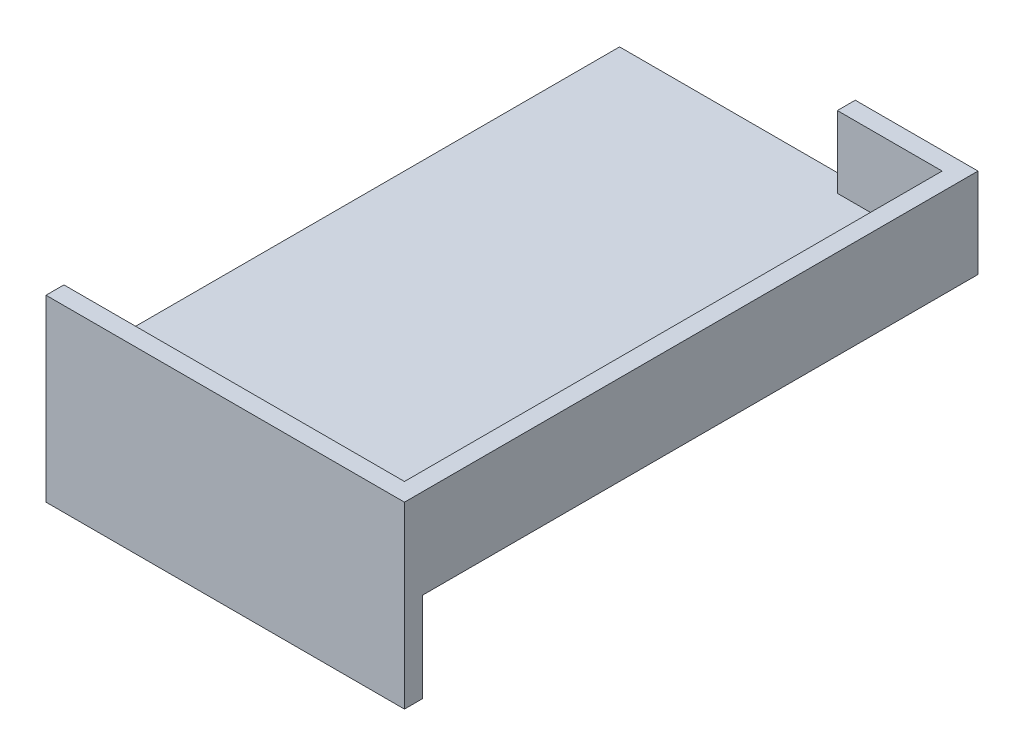
ISO-10303-21;
HEADER;
FILE_DESCRIPTION(('STEP AP214'),'2;1');
FILE_NAME('part.step','',(''),(''),'','','');
FILE_SCHEMA(('AUTOMOTIVE_DESIGN { 1 0 10303 214 1 1 1 1 }'));
ENDSEC;
DATA;
#1=APPLICATION_CONTEXT('core data for automotive mechanical design processes');
#2=APPLICATION_PROTOCOL_DEFINITION('international standard','automotive_design',2000,#1);
#3=PRODUCT_CONTEXT('',#1,'mechanical');
#4=PRODUCT('Part','Part','',(#3));
#5=PRODUCT_RELATED_PRODUCT_CATEGORY('part','',(#4));
#6=PRODUCT_DEFINITION_FORMATION('','',#4);
#7=PRODUCT_DEFINITION_CONTEXT('part definition',#1,'design');
#8=PRODUCT_DEFINITION('design','',#6,#7);
#9=PRODUCT_DEFINITION_SHAPE('','',#8);
#10=(LENGTH_UNIT() NAMED_UNIT(*) SI_UNIT(.MILLI.,.METRE.));
#11=(NAMED_UNIT(*) PLANE_ANGLE_UNIT() SI_UNIT($,.RADIAN.));
#12=(NAMED_UNIT(*) SI_UNIT($,.STERADIAN.) SOLID_ANGLE_UNIT());
#13=UNCERTAINTY_MEASURE_WITH_UNIT(LENGTH_MEASURE(1.E-05),#10,'distance_accuracy_value','');
#14=(GEOMETRIC_REPRESENTATION_CONTEXT(3) GLOBAL_UNCERTAINTY_ASSIGNED_CONTEXT((#13)) GLOBAL_UNIT_ASSIGNED_CONTEXT((#10,
#11,#12)) REPRESENTATION_CONTEXT('',''));
#15=CARTESIAN_POINT('',(0.,0.,0.));
#16=DIRECTION('',(0.,0.,1.));
#17=DIRECTION('',(1.,0.,0.));
#18=AXIS2_PLACEMENT_3D('',#15,#16,#17);
#19=CARTESIAN_POINT('',(0.,5.,0.));
#20=DIRECTION('',(0.,-1.,0.));
#21=DIRECTION('',(0.,0.,-1.));
#22=AXIS2_PLACEMENT_3D('',#19,#20,#21);
#23=PLANE('',#22);
#24=DIRECTION('',(-1.,0.,0.));
#25=VECTOR('',#24,1.);
#26=CARTESIAN_POINT('',(0.,5.,-155.));
#27=LINE('',#26,#25);
#28=CARTESIAN_POINT('',(45.,5.,-155.));
#29=VERTEX_POINT('',#28);
#30=CARTESIAN_POINT('',(15.7633115521065,5.,-155.));
#31=VERTEX_POINT('',#30);
#32=EDGE_CURVE('E148',#29,#31,#27,.T.);
#33=ORIENTED_EDGE('',*,*,#32,.T.);
#34=DIRECTION('',(0.,0.,-1.));
#35=VECTOR('',#34,1.);
#36=CARTESIAN_POINT('',(15.7633115521065,5.,0.));
#37=LINE('',#36,#35);
#38=CARTESIAN_POINT('',(15.7633115521065,5.,-160.));
#39=VERTEX_POINT('',#38);
#40=EDGE_CURVE('E132',#31,#39,#37,.T.);
#41=ORIENTED_EDGE('',*,*,#40,.T.);
#42=DIRECTION('',(-1.,0.,0.));
#43=VECTOR('',#42,1.);
#44=CARTESIAN_POINT('',(-50.,5.,-160.));
#45=LINE('',#44,#43);
#46=CARTESIAN_POINT('',(-50.,5.,-160.));
#47=VERTEX_POINT('',#46);
#48=EDGE_CURVE('E56',#39,#47,#45,.T.);
#49=ORIENTED_EDGE('',*,*,#48,.T.);
#50=DIRECTION('',(0.,0.,1.));
#51=VECTOR('',#50,1.);
#52=CARTESIAN_POINT('',(-50.,5.,0.));
#53=LINE('',#52,#51);
#54=CARTESIAN_POINT('',(-50.,5.,-5.));
#55=VERTEX_POINT('',#54);
#56=EDGE_CURVE('E194',#47,#55,#53,.T.);
#57=ORIENTED_EDGE('',*,*,#56,.T.);
#58=DIRECTION('',(-1.,0.,0.));
#59=VECTOR('',#58,1.);
#60=CARTESIAN_POINT('',(0.,5.,-5.));
#61=LINE('',#60,#59);
#62=CARTESIAN_POINT('',(45.,5.,-5.));
#63=VERTEX_POINT('',#62);
#64=EDGE_CURVE('E48',#63,#55,#61,.T.);
#65=ORIENTED_EDGE('',*,*,#64,.F.);
#66=DIRECTION('',(0.,0.,-1.));
#67=VECTOR('',#66,1.);
#68=CARTESIAN_POINT('',(45.,5.,0.));
#69=LINE('',#68,#67);
#70=EDGE_CURVE('E162',#63,#29,#69,.T.);
#71=ORIENTED_EDGE('',*,*,#70,.T.);
#72=EDGE_LOOP('',(#33,#41,#49,#57,#65,#71));
#73=FACE_BOUND('',#72,.T.);
#74=ADVANCED_FACE('F33',(#73),#23,.F.);
#75=CARTESIAN_POINT('',(0.,0.,0.));
#76=DIRECTION('',(0.,-1.,0.));
#77=DIRECTION('',(0.,0.,-1.));
#78=AXIS2_PLACEMENT_3D('',#75,#76,#77);
#79=PLANE('',#78);
#80=DIRECTION('',(0.,0.,1.));
#81=VECTOR('',#80,1.);
#82=CARTESIAN_POINT('',(-50.,0.,0.));
#83=LINE('',#82,#81);
#84=CARTESIAN_POINT('',(-50.,0.,-160.));
#85=VERTEX_POINT('',#84);
#86=CARTESIAN_POINT('',(-50.,0.,-5.));
#87=VERTEX_POINT('',#86);
#88=EDGE_CURVE('E193',#85,#87,#83,.T.);
#89=ORIENTED_EDGE('',*,*,#88,.F.);
#90=DIRECTION('',(-1.,0.,0.));
#91=VECTOR('',#90,1.);
#92=CARTESIAN_POINT('',(-50.,0.,-160.));
#93=LINE('',#92,#91);
#94=CARTESIAN_POINT('',(50.,0.,-160.));
#95=VERTEX_POINT('',#94);
#96=EDGE_CURVE('E196',#95,#85,#93,.T.);
#97=ORIENTED_EDGE('',*,*,#96,.F.);
#98=DIRECTION('',(0.,0.,-1.));
#99=VECTOR('',#98,1.);
#100=CARTESIAN_POINT('',(50.,0.,0.));
#101=LINE('',#100,#99);
#102=CARTESIAN_POINT('',(50.,0.,-5.));
#103=VERTEX_POINT('',#102);
#104=EDGE_CURVE('E69',#103,#95,#101,.T.);
#105=ORIENTED_EDGE('',*,*,#104,.F.);
#106=DIRECTION('',(-1.,0.,0.));
#107=VECTOR('',#106,1.);
#108=CARTESIAN_POINT('',(0.,0.,-5.));
#109=LINE('',#108,#107);
#110=EDGE_CURVE('E41',#103,#87,#109,.T.);
#111=ORIENTED_EDGE('',*,*,#110,.T.);
#112=EDGE_LOOP('',(#89,#97,#105,#111));
#113=FACE_BOUND('',#112,.T.);
#114=ADVANCED_FACE('F225',(#113),#79,.T.);
#115=CARTESIAN_POINT('',(-50.,5.,0.));
#116=DIRECTION('',(1.,0.,0.));
#117=DIRECTION('',(0.,0.,-1.));
#118=AXIS2_PLACEMENT_3D('',#115,#116,#117);
#119=PLANE('',#118);
#120=DIRECTION('',(0.,-1.,0.));
#121=VECTOR('',#120,1.);
#122=CARTESIAN_POINT('',(-50.,5.,0.));
#123=LINE('',#122,#121);
#124=CARTESIAN_POINT('',(-50.,25.,0.));
#125=VERTEX_POINT('',#124);
#126=CARTESIAN_POINT('',(-50.,-25.,0.));
#127=VERTEX_POINT('',#126);
#128=EDGE_CURVE('E209',#125,#127,#123,.T.);
#129=ORIENTED_EDGE('',*,*,#128,.F.);
#130=DIRECTION('',(0.,0.,1.));
#131=VECTOR('',#130,1.);
#132=CARTESIAN_POINT('',(-50.,25.,-5.));
#133=LINE('',#132,#131);
#134=CARTESIAN_POINT('',(-50.,25.,-5.));
#135=VERTEX_POINT('',#134);
#136=EDGE_CURVE('E188',#135,#125,#133,.T.);
#137=ORIENTED_EDGE('',*,*,#136,.F.);
#138=DIRECTION('',(0.,-1.,0.));
#139=VECTOR('',#138,1.);
#140=CARTESIAN_POINT('',(-50.,-25.,-5.));
#141=LINE('',#140,#139);
#142=EDGE_CURVE('E172',#135,#55,#141,.T.);
#143=ORIENTED_EDGE('',*,*,#142,.T.);
#144=ORIENTED_EDGE('',*,*,#56,.F.);
#145=DIRECTION('',(0.,-1.,0.));
#146=VECTOR('',#145,1.);
#147=CARTESIAN_POINT('',(-50.,5.,-160.));
#148=LINE('',#147,#146);
#149=EDGE_CURVE('E198',#47,#85,#148,.T.);
#150=ORIENTED_EDGE('',*,*,#149,.T.);
#151=ORIENTED_EDGE('',*,*,#88,.T.);
#152=CARTESIAN_POINT('',(-50.,-25.,-5.));
#153=VERTEX_POINT('',#152);
#154=EDGE_CURVE('E171',#87,#153,#141,.T.);
#155=ORIENTED_EDGE('',*,*,#154,.T.);
#156=DIRECTION('',(0.,0.,1.));
#157=VECTOR('',#156,1.);
#158=CARTESIAN_POINT('',(-50.,-25.,-5.));
#159=LINE('',#158,#157);
#160=EDGE_CURVE('E185',#153,#127,#159,.T.);
#161=ORIENTED_EDGE('',*,*,#160,.T.);
#162=EDGE_LOOP('',(#129,#137,#143,#144,#150,#151,#155,#161));
#163=FACE_BOUND('',#162,.T.);
#164=ADVANCED_FACE('F35',(#163),#119,.F.);
#165=CARTESIAN_POINT('',(-50.,5.,0.));
#166=DIRECTION('',(0.,0.,-1.));
#167=DIRECTION('',(-1.,0.,0.));
#168=AXIS2_PLACEMENT_3D('',#165,#166,#167);
#169=PLANE('',#168);
#170=DIRECTION('',(1.,0.,0.));
#171=VECTOR('',#170,1.);
#172=CARTESIAN_POINT('',(50.,-25.,0.));
#173=LINE('',#172,#171);
#174=CARTESIAN_POINT('',(50.,-25.,0.));
#175=VERTEX_POINT('',#174);
#176=EDGE_CURVE('E169',#127,#175,#173,.T.);
#177=ORIENTED_EDGE('',*,*,#176,.T.);
#178=DIRECTION('',(0.,-1.,0.));
#179=VECTOR('',#178,1.);
#180=CARTESIAN_POINT('',(50.,5.,0.));
#181=LINE('',#180,#179);
#182=CARTESIAN_POINT('',(50.,25.,0.));
#183=VERTEX_POINT('',#182);
#184=EDGE_CURVE('E207',#183,#175,#181,.T.);
#185=ORIENTED_EDGE('',*,*,#184,.F.);
#186=DIRECTION('',(-1.,0.,0.));
#187=VECTOR('',#186,1.);
#188=CARTESIAN_POINT('',(50.,25.,0.));
#189=LINE('',#188,#187);
#190=EDGE_CURVE('E165',#183,#125,#189,.T.);
#191=ORIENTED_EDGE('',*,*,#190,.T.);
#192=ORIENTED_EDGE('',*,*,#128,.T.);
#193=EDGE_LOOP('',(#177,#185,#191,#192));
#194=FACE_BOUND('',#193,.T.);
#195=ADVANCED_FACE('F212',(#194),#169,.F.);
#196=CARTESIAN_POINT('',(50.,5.,0.));
#197=DIRECTION('',(-1.,0.,0.));
#198=DIRECTION('',(0.,0.,1.));
#199=AXIS2_PLACEMENT_3D('',#196,#197,#198);
#200=PLANE('',#199);
#201=ORIENTED_EDGE('',*,*,#104,.T.);
#202=DIRECTION('',(0.,-1.,0.));
#203=VECTOR('',#202,1.);
#204=CARTESIAN_POINT('',(50.,5.,-160.));
#205=LINE('',#204,#203);
#206=CARTESIAN_POINT('',(50.,25.,-160.));
#207=VERTEX_POINT('',#206);
#208=EDGE_CURVE('E205',#207,#95,#205,.T.);
#209=ORIENTED_EDGE('',*,*,#208,.F.);
#210=DIRECTION('',(0.,0.,1.));
#211=VECTOR('',#210,1.);
#212=CARTESIAN_POINT('',(50.,25.,-5.));
#213=LINE('',#212,#211);
#214=EDGE_CURVE('E178',#207,#183,#213,.T.);
#215=ORIENTED_EDGE('',*,*,#214,.T.);
#216=ORIENTED_EDGE('',*,*,#184,.T.);
#217=DIRECTION('',(0.,0.,1.));
#218=VECTOR('',#217,1.);
#219=CARTESIAN_POINT('',(50.,-25.,-5.));
#220=LINE('',#219,#218);
#221=CARTESIAN_POINT('',(50.,-25.,-5.));
#222=VERTEX_POINT('',#221);
#223=EDGE_CURVE('E182',#222,#175,#220,.T.);
#224=ORIENTED_EDGE('',*,*,#223,.F.);
#225=DIRECTION('',(0.,1.,0.));
#226=VECTOR('',#225,1.);
#227=CARTESIAN_POINT('',(50.,-25.,-5.));
#228=LINE('',#227,#226);
#229=EDGE_CURVE('E166',#222,#103,#228,.T.);
#230=ORIENTED_EDGE('',*,*,#229,.T.);
#231=EDGE_LOOP('',(#201,#209,#215,#216,#224,#230));
#232=FACE_BOUND('',#231,.T.);
#233=ADVANCED_FACE('F221',(#232),#200,.F.);
#234=CARTESIAN_POINT('',(-50.,5.,-160.));
#235=DIRECTION('',(0.,0.,1.));
#236=DIRECTION('',(1.,0.,0.));
#237=AXIS2_PLACEMENT_3D('',#234,#235,#236);
#238=PLANE('',#237);
#239=ORIENTED_EDGE('',*,*,#48,.F.);
#240=DIRECTION('',(0.,1.,0.));
#241=VECTOR('',#240,1.);
#242=CARTESIAN_POINT('',(15.7633115521065,0.,-160.));
#243=LINE('',#242,#241);
#244=CARTESIAN_POINT('',(15.7633115521065,25.,-160.));
#245=VERTEX_POINT('',#244);
#246=EDGE_CURVE('E137',#39,#245,#243,.T.);
#247=ORIENTED_EDGE('',*,*,#246,.T.);
#248=DIRECTION('',(1.,0.,0.));
#249=VECTOR('',#248,1.);
#250=CARTESIAN_POINT('',(45.,25.,-160.));
#251=LINE('',#250,#249);
#252=EDGE_CURVE('E146',#245,#207,#251,.T.);
#253=ORIENTED_EDGE('',*,*,#252,.T.);
#254=ORIENTED_EDGE('',*,*,#208,.T.);
#255=ORIENTED_EDGE('',*,*,#96,.T.);
#256=ORIENTED_EDGE('',*,*,#149,.F.);
#257=EDGE_LOOP('',(#239,#247,#253,#254,#255,#256));
#258=FACE_BOUND('',#257,.T.);
#259=ADVANCED_FACE('F227',(#258),#238,.F.);
#260=CARTESIAN_POINT('',(50.,-25.,-5.));
#261=DIRECTION('',(0.,-1.,0.));
#262=DIRECTION('',(1.,0.,0.));
#263=AXIS2_PLACEMENT_3D('',#260,#261,#262);
#264=PLANE('',#263);
#265=ORIENTED_EDGE('',*,*,#176,.F.);
#266=ORIENTED_EDGE('',*,*,#160,.F.);
#267=DIRECTION('',(1.,0.,0.));
#268=VECTOR('',#267,1.);
#269=CARTESIAN_POINT('',(50.,-25.,-5.));
#270=LINE('',#269,#268);
#271=EDGE_CURVE('E175',#153,#222,#270,.T.);
#272=ORIENTED_EDGE('',*,*,#271,.T.);
#273=ORIENTED_EDGE('',*,*,#223,.T.);
#274=EDGE_LOOP('',(#265,#266,#272,#273));
#275=FACE_BOUND('',#274,.T.);
#276=ADVANCED_FACE('F220',(#275),#264,.T.);
#277=CARTESIAN_POINT('',(0.,0.,-5.));
#278=DIRECTION('',(0.,0.,1.));
#279=DIRECTION('',(1.,0.,0.));
#280=AXIS2_PLACEMENT_3D('',#277,#278,#279);
#281=PLANE('',#280);
#282=ORIENTED_EDGE('',*,*,#110,.F.);
#283=ORIENTED_EDGE('',*,*,#229,.F.);
#284=ORIENTED_EDGE('',*,*,#271,.F.);
#285=ORIENTED_EDGE('',*,*,#154,.F.);
#286=EDGE_LOOP('',(#282,#283,#284,#285));
#287=FACE_BOUND('',#286,.T.);
#288=ADVANCED_FACE('F222',(#287),#281,.F.);
#289=DIRECTION('',(-1.,0.,0.));
#290=VECTOR('',#289,1.);
#291=CARTESIAN_POINT('',(50.,25.,-5.));
#292=LINE('',#291,#290);
#293=CARTESIAN_POINT('',(45.,25.,-5.));
#294=VERTEX_POINT('',#293);
#295=EDGE_CURVE('E168',#294,#135,#292,.T.);
#296=ORIENTED_EDGE('',*,*,#295,.F.);
#297=DIRECTION('',(0.,-1.,0.));
#298=VECTOR('',#297,1.);
#299=CARTESIAN_POINT('',(45.,0.,-5.));
#300=LINE('',#299,#298);
#301=EDGE_CURVE('E160',#294,#63,#300,.T.);
#302=ORIENTED_EDGE('',*,*,#301,.T.);
#303=ORIENTED_EDGE('',*,*,#64,.T.);
#304=ORIENTED_EDGE('',*,*,#142,.F.);
#305=EDGE_LOOP('',(#296,#302,#303,#304));
#306=FACE_BOUND('',#305,.T.);
#307=ADVANCED_FACE('F229',(#306),#281,.F.);
#308=CARTESIAN_POINT('',(50.,25.,-5.));
#309=DIRECTION('',(0.,1.,0.));
#310=DIRECTION('',(-1.,0.,0.));
#311=AXIS2_PLACEMENT_3D('',#308,#309,#310);
#312=PLANE('',#311);
#313=ORIENTED_EDGE('',*,*,#190,.F.);
#314=ORIENTED_EDGE('',*,*,#214,.F.);
#315=ORIENTED_EDGE('',*,*,#252,.F.);
#316=DIRECTION('',(0.,0.,-1.));
#317=VECTOR('',#316,1.);
#318=CARTESIAN_POINT('',(15.7633115521065,25.,-155.));
#319=LINE('',#318,#317);
#320=CARTESIAN_POINT('',(15.7633115521065,25.,-155.));
#321=VERTEX_POINT('',#320);
#322=EDGE_CURVE('E131',#321,#245,#319,.T.);
#323=ORIENTED_EDGE('',*,*,#322,.F.);
#324=DIRECTION('',(1.,0.,0.));
#325=VECTOR('',#324,1.);
#326=CARTESIAN_POINT('',(50.,25.,-155.));
#327=LINE('',#326,#325);
#328=CARTESIAN_POINT('',(45.,25.,-155.));
#329=VERTEX_POINT('',#328);
#330=EDGE_CURVE('E136',#321,#329,#327,.T.);
#331=ORIENTED_EDGE('',*,*,#330,.T.);
#332=DIRECTION('',(0.,0.,1.));
#333=VECTOR('',#332,1.);
#334=CARTESIAN_POINT('',(45.,25.,0.));
#335=LINE('',#334,#333);
#336=EDGE_CURVE('E157',#329,#294,#335,.T.);
#337=ORIENTED_EDGE('',*,*,#336,.T.);
#338=ORIENTED_EDGE('',*,*,#295,.T.);
#339=ORIENTED_EDGE('',*,*,#136,.T.);
#340=EDGE_LOOP('',(#313,#314,#315,#323,#331,#337,#338,#339));
#341=FACE_BOUND('',#340,.T.);
#342=ADVANCED_FACE('F142',(#341),#312,.T.);
#343=CARTESIAN_POINT('',(45.,0.,0.));
#344=DIRECTION('',(-1.,0.,0.));
#345=DIRECTION('',(0.,0.,1.));
#346=AXIS2_PLACEMENT_3D('',#343,#344,#345);
#347=PLANE('',#346);
#348=DIRECTION('',(0.,1.,0.));
#349=VECTOR('',#348,1.);
#350=CARTESIAN_POINT('',(45.,0.,-155.));
#351=LINE('',#350,#349);
#352=EDGE_CURVE('E11',#29,#329,#351,.T.);
#353=ORIENTED_EDGE('',*,*,#352,.F.);
#354=ORIENTED_EDGE('',*,*,#70,.F.);
#355=ORIENTED_EDGE('',*,*,#301,.F.);
#356=ORIENTED_EDGE('',*,*,#336,.F.);
#357=EDGE_LOOP('',(#353,#354,#355,#356));
#358=FACE_BOUND('',#357,.T.);
#359=ADVANCED_FACE('F232',(#358),#347,.T.);
#360=CARTESIAN_POINT('',(15.7633115521065,0.,-155.));
#361=DIRECTION('',(-1.,0.,0.));
#362=DIRECTION('',(0.,0.,1.));
#363=AXIS2_PLACEMENT_3D('',#360,#361,#362);
#364=PLANE('',#363);
#365=ORIENTED_EDGE('',*,*,#40,.F.);
#366=DIRECTION('',(0.,1.,0.));
#367=VECTOR('',#366,1.);
#368=CARTESIAN_POINT('',(15.7633115521065,0.,-155.));
#369=LINE('',#368,#367);
#370=EDGE_CURVE('E128',#31,#321,#369,.T.);
#371=ORIENTED_EDGE('',*,*,#370,.T.);
#372=ORIENTED_EDGE('',*,*,#322,.T.);
#373=ORIENTED_EDGE('',*,*,#246,.F.);
#374=EDGE_LOOP('',(#365,#371,#372,#373));
#375=FACE_BOUND('',#374,.T.);
#376=ADVANCED_FACE('F130',(#375),#364,.T.);
#377=CARTESIAN_POINT('',(0.,0.,-155.));
#378=DIRECTION('',(0.,0.,1.));
#379=DIRECTION('',(1.,0.,0.));
#380=AXIS2_PLACEMENT_3D('',#377,#378,#379);
#381=PLANE('',#380);
#382=ORIENTED_EDGE('',*,*,#32,.F.);
#383=ORIENTED_EDGE('',*,*,#352,.T.);
#384=ORIENTED_EDGE('',*,*,#330,.F.);
#385=ORIENTED_EDGE('',*,*,#370,.F.);
#386=EDGE_LOOP('',(#382,#383,#384,#385));
#387=FACE_BOUND('',#386,.T.);
#388=ADVANCED_FACE('F150',(#387),#381,.T.);
#389=CLOSED_SHELL('',(#74,#114,#164,#195,#233,#259,#276,#288,#307,#342,#359,#376,#388));
#390=MANIFOLD_SOLID_BREP('B2',#389);
#391=ADVANCED_BREP_SHAPE_REPRESENTATION('',(#18,#390),#14);
#392=SHAPE_DEFINITION_REPRESENTATION(#9,#391);
ENDSEC;
END-ISO-10303-21;
